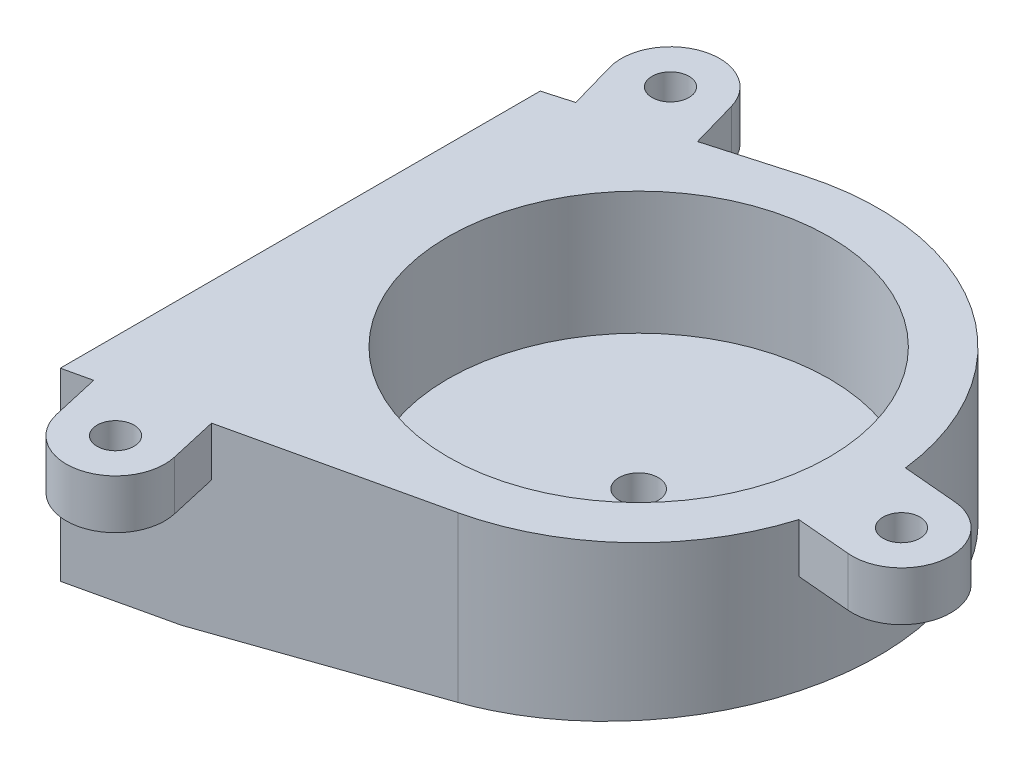
ISO-10303-21;
HEADER;
FILE_DESCRIPTION(('STEP AP214'),'2;1');
FILE_NAME('part.step','',(''),(''),'','','');
FILE_SCHEMA(('AUTOMOTIVE_DESIGN { 1 0 10303 214 1 1 1 1 }'));
ENDSEC;
DATA;
#1=APPLICATION_CONTEXT('core data for automotive mechanical design processes');
#2=APPLICATION_PROTOCOL_DEFINITION('international standard','automotive_design',2000,#1);
#3=PRODUCT_CONTEXT('',#1,'mechanical');
#4=PRODUCT('Part','Part','',(#3));
#5=PRODUCT_RELATED_PRODUCT_CATEGORY('part','',(#4));
#6=PRODUCT_DEFINITION_FORMATION('','',#4);
#7=PRODUCT_DEFINITION_CONTEXT('part definition',#1,'design');
#8=PRODUCT_DEFINITION('design','',#6,#7);
#9=PRODUCT_DEFINITION_SHAPE('','',#8);
#10=(LENGTH_UNIT() NAMED_UNIT(*) SI_UNIT(.MILLI.,.METRE.));
#11=(NAMED_UNIT(*) PLANE_ANGLE_UNIT() SI_UNIT($,.RADIAN.));
#12=(NAMED_UNIT(*) SI_UNIT($,.STERADIAN.) SOLID_ANGLE_UNIT());
#13=UNCERTAINTY_MEASURE_WITH_UNIT(LENGTH_MEASURE(1.E-05),#10,'distance_accuracy_value','');
#14=(GEOMETRIC_REPRESENTATION_CONTEXT(3) GLOBAL_UNCERTAINTY_ASSIGNED_CONTEXT((#13)) GLOBAL_UNIT_ASSIGNED_CONTEXT((#10,
#11,#12)) REPRESENTATION_CONTEXT('',''));
#15=CARTESIAN_POINT('',(0.,0.,0.));
#16=DIRECTION('',(0.,0.,1.));
#17=DIRECTION('',(1.,0.,0.));
#18=AXIS2_PLACEMENT_3D('',#15,#16,#17);
#19=CARTESIAN_POINT('',(4.32348319389158,15.,19.0146652106246));
#20=DIRECTION('',(0.221717086866235,0.,0.975111036442287));
#21=DIRECTION('',(0.975111036442287,0.,-0.221717086866235));
#22=AXIS2_PLACEMENT_3D('',#19,#20,#21);
#23=PLANE('',#22);
#24=DIRECTION('',(0.975111036442287,0.,-0.221717086866235));
#25=VECTOR('',#24,1.);
#26=CARTESIAN_POINT('',(4.32348319389158,11.,19.0146652106246));
#27=LINE('',#26,#25);
#28=CARTESIAN_POINT('',(-19.7873124932341,11.,24.4968874212158));
#29=VERTEX_POINT('',#28);
#30=CARTESIAN_POINT('',(-11.9864242016958,11.,22.7231507262859));
#31=VERTEX_POINT('',#30);
#32=EDGE_CURVE('E207',#29,#31,#27,.T.);
#33=ORIENTED_EDGE('',*,*,#32,.F.);
#34=DIRECTION('',(0.,1.,0.));
#35=VECTOR('',#34,1.);
#36=CARTESIAN_POINT('',(-19.7873124932341,11.,24.4968874212158));
#37=LINE('',#36,#35);
#38=CARTESIAN_POINT('',(-19.7873124932341,15.,24.4968874212158));
#39=VERTEX_POINT('',#38);
#40=EDGE_CURVE('E221',#29,#39,#37,.T.);
#41=ORIENTED_EDGE('',*,*,#40,.T.);
#42=DIRECTION('',(-0.975111036442287,0.,0.221717086866235));
#43=VECTOR('',#42,1.);
#44=CARTESIAN_POINT('',(4.32348319389158,15.,19.0146652106246));
#45=LINE('',#44,#43);
#46=CARTESIAN_POINT('',(-22.,15.,25.));
#47=VERTEX_POINT('',#46);
#48=EDGE_CURVE('E305',#39,#47,#45,.T.);
#49=ORIENTED_EDGE('',*,*,#48,.T.);
#50=DIRECTION('',(0.,-1.,0.));
#51=VECTOR('',#50,1.);
#52=CARTESIAN_POINT('',(-22.,15.,25.));
#53=LINE('',#52,#51);
#54=CARTESIAN_POINT('',(-22.,0.,25.));
#55=VERTEX_POINT('',#54);
#56=EDGE_CURVE('E320',#47,#55,#53,.T.);
#57=ORIENTED_EDGE('',*,*,#56,.T.);
#58=DIRECTION('',(-0.975111036442287,0.,0.221717086866235));
#59=VECTOR('',#58,1.);
#60=CARTESIAN_POINT('',(4.32348319389158,0.,19.0146652106246));
#61=LINE('',#60,#59);
#62=CARTESIAN_POINT('',(-14.,0.,23.1809900322722));
#63=VERTEX_POINT('',#62);
#64=EDGE_CURVE('E314',#63,#55,#61,.T.);
#65=ORIENTED_EDGE('',*,*,#64,.F.);
#66=DIRECTION('',(0.971414372160437,0.0869923318352629,-0.220876553219231));
#67=VECTOR('',#66,1.);
#68=CARTESIAN_POINT('',(5.4524012180103,1.7420060792248,18.7579760682972));
#69=LINE('',#68,#67);
#70=CARTESIAN_POINT('',(4.32348319389158,1.64090894273656,19.0146652106246));
#71=VERTEX_POINT('',#70);
#72=EDGE_CURVE('E288',#63,#71,#69,.T.);
#73=ORIENTED_EDGE('',*,*,#72,.T.);
#74=DIRECTION('',(0.,-1.,0.));
#75=VECTOR('',#74,1.);
#76=CARTESIAN_POINT('',(4.32348319389158,15.,19.0146652106246));
#77=LINE('',#76,#75);
#78=CARTESIAN_POINT('',(4.32348319389158,15.,19.0146652106246));
#79=VERTEX_POINT('',#78);
#80=EDGE_CURVE('E323',#79,#71,#77,.T.);
#81=ORIENTED_EDGE('',*,*,#80,.F.);
#82=CARTESIAN_POINT('',(-11.9864242016958,15.,22.7231507262859));
#83=VERTEX_POINT('',#82);
#84=EDGE_CURVE('E306',#79,#83,#45,.T.);
#85=ORIENTED_EDGE('',*,*,#84,.T.);
#86=DIRECTION('',(0.,1.,0.));
#87=VECTOR('',#86,1.);
#88=CARTESIAN_POINT('',(-11.9864242016958,11.,22.7231507262859));
#89=LINE('',#88,#87);
#90=EDGE_CURVE('E225',#31,#83,#89,.T.);
#91=ORIENTED_EDGE('',*,*,#90,.F.);
#92=EDGE_LOOP('',(#33,#41,#49,#57,#65,#73,#81,#85,#91));
#93=FACE_BOUND('',#92,.T.);
#94=ADVANCED_FACE('F34',(#93),#23,.T.);
#95=CARTESIAN_POINT('',(-5.35142928494359,15.,-18.7513254093743));
#96=DIRECTION('',(-0.274432271022749,0.,-0.961606431249967));
#97=DIRECTION('',(-0.961606431249967,0.,0.274432271022749));
#98=AXIS2_PLACEMENT_3D('',#95,#96,#97);
#99=PLANE('',#98);
#100=DIRECTION('',(-0.961606431249967,0.,0.274432271022748));
#101=VECTOR('',#100,1.);
#102=CARTESIAN_POINT('',(-5.35142928494359,11.,-18.7513254093743));
#103=LINE('',#102,#101);
#104=CARTESIAN_POINT('',(-12.0558451909091,11.,-16.8379562562963));
#105=VERTEX_POINT('',#104);
#106=CARTESIAN_POINT('',(-19.7486966409089,11.,-14.6424980881143));
#107=VERTEX_POINT('',#106);
#108=EDGE_CURVE('E244',#105,#107,#103,.T.);
#109=ORIENTED_EDGE('',*,*,#108,.F.);
#110=DIRECTION('',(0.,1.,0.));
#111=VECTOR('',#110,1.);
#112=CARTESIAN_POINT('',(-12.0558451909091,11.,-16.8379562562963));
#113=LINE('',#112,#111);
#114=CARTESIAN_POINT('',(-12.0558451909091,15.,-16.8379562562963));
#115=VERTEX_POINT('',#114);
#116=EDGE_CURVE('E258',#105,#115,#113,.T.);
#117=ORIENTED_EDGE('',*,*,#116,.T.);
#118=DIRECTION('',(0.961606431249967,0.,-0.274432271022748));
#119=VECTOR('',#118,1.);
#120=CARTESIAN_POINT('',(-5.35142928494359,15.,-18.7513254093743));
#121=LINE('',#120,#119);
#122=CARTESIAN_POINT('',(-5.3514292849436,15.,-18.7513254093743));
#123=VERTEX_POINT('',#122);
#124=EDGE_CURVE('E298',#115,#123,#121,.T.);
#125=ORIENTED_EDGE('',*,*,#124,.T.);
#126=DIRECTION('',(0.,-1.,0.));
#127=VECTOR('',#126,1.);
#128=CARTESIAN_POINT('',(-5.3514292849436,15.,-18.7513254093743));
#129=LINE('',#128,#127);
#130=CARTESIAN_POINT('',(-5.3514292849436,0.774498870005051,-18.7513254093743));
#131=VERTEX_POINT('',#130);
#132=EDGE_CURVE('E311',#123,#131,#129,.T.);
#133=ORIENTED_EDGE('',*,*,#132,.T.);
#134=DIRECTION('',(-0.958060684401584,-0.0857964792001418,0.273420352499275));
#135=VECTOR('',#134,1.);
#136=CARTESIAN_POINT('',(-4.18211822024305,0.879213293709578,-19.0850343786464));
#137=LINE('',#136,#135);
#138=CARTESIAN_POINT('',(-14.,0.,-16.2831151049272));
#139=VERTEX_POINT('',#138);
#140=EDGE_CURVE('E291',#131,#139,#137,.T.);
#141=ORIENTED_EDGE('',*,*,#140,.T.);
#142=DIRECTION('',(0.961606431249967,0.,-0.274432271022748));
#143=VECTOR('',#142,1.);
#144=CARTESIAN_POINT('',(-5.35142928494359,0.,-18.7513254093743));
#145=LINE('',#144,#143);
#146=CARTESIAN_POINT('',(-22.,0.,-14.));
#147=VERTEX_POINT('',#146);
#148=EDGE_CURVE('E294',#147,#139,#145,.T.);
#149=ORIENTED_EDGE('',*,*,#148,.F.);
#150=DIRECTION('',(0.,-1.,0.));
#151=VECTOR('',#150,1.);
#152=CARTESIAN_POINT('',(-22.,15.,-14.));
#153=LINE('',#152,#151);
#154=CARTESIAN_POINT('',(-22.,15.,-14.));
#155=VERTEX_POINT('',#154);
#156=EDGE_CURVE('E318',#155,#147,#153,.T.);
#157=ORIENTED_EDGE('',*,*,#156,.F.);
#158=CARTESIAN_POINT('',(-19.7486966409089,15.,-14.6424980881143));
#159=VERTEX_POINT('',#158);
#160=EDGE_CURVE('E300',#155,#159,#121,.T.);
#161=ORIENTED_EDGE('',*,*,#160,.T.);
#162=DIRECTION('',(0.,1.,0.));
#163=VECTOR('',#162,1.);
#164=CARTESIAN_POINT('',(-19.7486966409089,11.,-14.6424980881143));
#165=LINE('',#164,#163);
#166=EDGE_CURVE('E262',#107,#159,#165,.T.);
#167=ORIENTED_EDGE('',*,*,#166,.F.);
#168=EDGE_LOOP('',(#109,#117,#125,#133,#141,#149,#157,#161,#167));
#169=FACE_BOUND('',#168,.T.);
#170=ADVANCED_FACE('F367',(#169),#99,.T.);
#171=CARTESIAN_POINT('',(0.,15.,0.));
#172=DIRECTION('',(0.,-1.,0.));
#173=DIRECTION('',(0.,0.,-1.));
#174=AXIS2_PLACEMENT_3D('',#171,#172,#173);
#175=CYLINDRICAL_SURFACE('',#174,19.5);
#176=DIRECTION('',(0.,1.,0.));
#177=VECTOR('',#176,1.);
#178=CARTESIAN_POINT('',(18.664086252509,11.,5.64817531233798));
#179=LINE('',#178,#177);
#180=CARTESIAN_POINT('',(18.664086252509,11.,5.64817531233798));
#181=VERTEX_POINT('',#180);
#182=CARTESIAN_POINT('',(18.664086252509,15.,5.64817531233798));
#183=VERTEX_POINT('',#182);
#184=EDGE_CURVE('E174',#181,#183,#179,.T.);
#185=ORIENTED_EDGE('',*,*,#184,.T.);
#186=CARTESIAN_POINT('',(0.,15.,0.));
#187=DIRECTION('',(0.,-1.,0.));
#188=DIRECTION('',(0.,0.,-1.));
#189=AXIS2_PLACEMENT_3D('',#186,#187,#188);
#190=CIRCLE('',#189,19.5);
#191=EDGE_CURVE('E302',#183,#79,#190,.T.);
#192=ORIENTED_EDGE('',*,*,#191,.T.);
#193=ORIENTED_EDGE('',*,*,#80,.T.);
#194=CARTESIAN_POINT('',(0.,1.25373134328358,0.));
#195=DIRECTION('',(0.0891952975496599,-0.996014155971203,0.));
#196=DIRECTION('',(-0.996014155971203,-0.0891952975496599,0.));
#197=AXIS2_PLACEMENT_3D('',#194,#195,#196);
#198=ELLIPSE('',#197,19.5780349938759,19.5);
#199=EDGE_CURVE('E285',#71,#131,#198,.F.);
#200=ORIENTED_EDGE('',*,*,#199,.T.);
#201=ORIENTED_EDGE('',*,*,#132,.F.);
#202=CARTESIAN_POINT('',(19.3613321944903,15.,-2.32138227239599));
#203=VERTEX_POINT('',#202);
#204=EDGE_CURVE('E303',#123,#203,#190,.T.);
#205=ORIENTED_EDGE('',*,*,#204,.T.);
#206=DIRECTION('',(0.,1.,0.));
#207=VECTOR('',#206,1.);
#208=CARTESIAN_POINT('',(19.3613321944903,11.,-2.32138227239599));
#209=LINE('',#208,#207);
#210=CARTESIAN_POINT('',(19.3613321944903,11.,-2.32138227239599));
#211=VERTEX_POINT('',#210);
#212=EDGE_CURVE('E54',#211,#203,#209,.T.);
#213=ORIENTED_EDGE('',*,*,#212,.F.);
#214=CARTESIAN_POINT('',(0.,11.,0.));
#215=DIRECTION('',(0.,1.,0.));
#216=DIRECTION('',(0.,0.,1.));
#217=AXIS2_PLACEMENT_3D('',#214,#215,#216);
#218=CIRCLE('',#217,19.5);
#219=EDGE_CURVE('E49',#181,#211,#218,.T.);
#220=ORIENTED_EDGE('',*,*,#219,.F.);
#221=EDGE_LOOP('',(#185,#192,#193,#200,#201,#205,#213,#220));
#222=FACE_BOUND('',#221,.T.);
#223=ADVANCED_FACE('F373',(#222),#175,.T.);
#224=CARTESIAN_POINT('',(0.,0.,0.));
#225=DIRECTION('',(0.,1.,0.));
#226=DIRECTION('',(0.,0.,1.));
#227=AXIS2_PLACEMENT_3D('',#224,#225,#226);
#228=PLANE('',#227);
#229=CARTESIAN_POINT('',(-18.,0.,5.5));
#230=DIRECTION('',(0.,-1.,0.));
#231=DIRECTION('',(0.,0.,-1.));
#232=AXIS2_PLACEMENT_3D('',#229,#230,#231);
#233=CIRCLE('',#232,2.05);
#234=CARTESIAN_POINT('',(-18.,0.,3.45));
#235=VERTEX_POINT('',#234);
#236=EDGE_CURVE('E274',#235,#235,#233,.T.);
#237=ORIENTED_EDGE('',*,*,#236,.F.);
#238=EDGE_LOOP('',(#237));
#239=FACE_BOUND('',#238,.T.);
#240=DIRECTION('',(0.,0.,-1.));
#241=VECTOR('',#240,1.);
#242=CARTESIAN_POINT('',(-14.,0.,0.));
#243=LINE('',#242,#241);
#244=EDGE_CURVE('E11',#63,#139,#243,.T.);
#245=ORIENTED_EDGE('',*,*,#244,.F.);
#246=ORIENTED_EDGE('',*,*,#64,.T.);
#247=DIRECTION('',(0.,0.,-1.));
#248=VECTOR('',#247,1.);
#249=CARTESIAN_POINT('',(-22.,0.,0.));
#250=LINE('',#249,#248);
#251=EDGE_CURVE('E299',#55,#147,#250,.T.);
#252=ORIENTED_EDGE('',*,*,#251,.T.);
#253=ORIENTED_EDGE('',*,*,#148,.T.);
#254=EDGE_LOOP('',(#245,#246,#252,#253));
#255=FACE_BOUND('',#254,.T.);
#256=ADVANCED_FACE('F36',(#239,#255),#228,.F.);
#257=CARTESIAN_POINT('',(0.,5.,0.));
#258=DIRECTION('',(0.,1.,0.));
#259=DIRECTION('',(0.,0.,1.));
#260=AXIS2_PLACEMENT_3D('',#257,#258,#259);
#261=PLANE('',#260);
#262=CARTESIAN_POINT('',(0.,5.,0.));
#263=DIRECTION('',(0.,1.,0.));
#264=DIRECTION('',(0.,0.,1.));
#265=AXIS2_PLACEMENT_3D('',#262,#263,#264);
#266=CIRCLE('',#265,1.6);
#267=CARTESIAN_POINT('',(0.,5.,1.6));
#268=VERTEX_POINT('',#267);
#269=EDGE_CURVE('E280',#268,#268,#266,.T.);
#270=ORIENTED_EDGE('',*,*,#269,.F.);
#271=EDGE_LOOP('',(#270));
#272=FACE_BOUND('',#271,.T.);
#273=CARTESIAN_POINT('',(0.,5.,0.));
#274=DIRECTION('',(0.,1.,0.));
#275=DIRECTION('',(0.,0.,1.));
#276=AXIS2_PLACEMENT_3D('',#273,#274,#275);
#277=CIRCLE('',#276,15.5);
#278=CARTESIAN_POINT('',(0.,5.,15.5));
#279=VERTEX_POINT('',#278);
#280=EDGE_CURVE('E42',#279,#279,#277,.T.);
#281=ORIENTED_EDGE('',*,*,#280,.T.);
#282=EDGE_LOOP('',(#281));
#283=FACE_BOUND('',#282,.T.);
#284=ADVANCED_FACE('F330',(#272,#283),#261,.T.);
#285=CARTESIAN_POINT('',(-22.,15.,0.));
#286=DIRECTION('',(-1.,0.,0.));
#287=DIRECTION('',(0.,0.,1.));
#288=AXIS2_PLACEMENT_3D('',#285,#286,#287);
#289=PLANE('',#288);
#290=ORIENTED_EDGE('',*,*,#251,.F.);
#291=ORIENTED_EDGE('',*,*,#56,.F.);
#292=DIRECTION('',(0.,0.,-1.));
#293=VECTOR('',#292,1.);
#294=CARTESIAN_POINT('',(-22.,15.,0.));
#295=LINE('',#294,#293);
#296=EDGE_CURVE('E308',#47,#155,#295,.T.);
#297=ORIENTED_EDGE('',*,*,#296,.T.);
#298=ORIENTED_EDGE('',*,*,#156,.T.);
#299=EDGE_LOOP('',(#290,#291,#297,#298));
#300=FACE_BOUND('',#299,.T.);
#301=ADVANCED_FACE('F336',(#300),#289,.T.);
#302=CARTESIAN_POINT('',(0.,15.,0.));
#303=DIRECTION('',(0.,-1.,0.));
#304=DIRECTION('',(0.,0.,-1.));
#305=AXIS2_PLACEMENT_3D('',#302,#303,#304);
#306=CYLINDRICAL_SURFACE('',#305,15.5);
#307=ORIENTED_EDGE('',*,*,#280,.F.);
#308=EDGE_LOOP('',(#307));
#309=FACE_BOUND('',#308,.T.);
#310=CARTESIAN_POINT('',(0.,15.,0.));
#311=DIRECTION('',(0.,-1.,0.));
#312=DIRECTION('',(0.,0.,-1.));
#313=AXIS2_PLACEMENT_3D('',#310,#311,#312);
#314=CIRCLE('',#313,15.5);
#315=CARTESIAN_POINT('',(0.,15.,-15.5));
#316=VERTEX_POINT('',#315);
#317=EDGE_CURVE('E295',#316,#316,#314,.T.);
#318=ORIENTED_EDGE('',*,*,#317,.F.);
#319=EDGE_LOOP('',(#318));
#320=FACE_BOUND('',#319,.T.);
#321=ADVANCED_FACE('F332',(#309,#320),#306,.F.);
#322=CARTESIAN_POINT('',(0.,15.,0.));
#323=DIRECTION('',(0.,-1.,0.));
#324=DIRECTION('',(0.,0.,-1.));
#325=AXIS2_PLACEMENT_3D('',#322,#323,#324);
#326=PLANE('',#325);
#327=ORIENTED_EDGE('',*,*,#317,.T.);
#328=EDGE_LOOP('',(#327));
#329=FACE_BOUND('',#328,.T.);
#330=ORIENTED_EDGE('',*,*,#160,.F.);
#331=ORIENTED_EDGE('',*,*,#296,.F.);
#332=ORIENTED_EDGE('',*,*,#48,.F.);
#333=DIRECTION('',(-0.221717086866236,0.,-0.975111036442286));
#334=VECTOR('',#333,1.);
#335=CARTESIAN_POINT('',(-24.1107956871257,15.,5.48222221059121));
#336=LINE('',#335,#334);
#337=CARTESIAN_POINT('',(-18.9004441457691,15.,28.3973315669849));
#338=VERTEX_POINT('',#337);
#339=EDGE_CURVE('E213',#338,#39,#336,.T.);
#340=ORIENTED_EDGE('',*,*,#339,.F.);
#341=CARTESIAN_POINT('',(-15.,15.,27.51046321952));
#342=DIRECTION('',(0.,1.,0.));
#343=DIRECTION('',(0.,0.,1.));
#344=AXIS2_PLACEMENT_3D('',#341,#342,#343);
#345=CIRCLE('',#344,4.);
#346=CARTESIAN_POINT('',(-11.0995558542309,15.,26.623594872055));
#347=VERTEX_POINT('',#346);
#348=EDGE_CURVE('E216',#338,#347,#345,.T.);
#349=ORIENTED_EDGE('',*,*,#348,.T.);
#350=DIRECTION('',(-0.221717086866235,0.,-0.975111036442287));
#351=VECTOR('',#350,1.);
#352=CARTESIAN_POINT('',(-16.3099073955874,15.,3.7084855156613));
#353=LINE('',#352,#351);
#354=EDGE_CURVE('E198',#347,#83,#353,.T.);
#355=ORIENTED_EDGE('',*,*,#354,.T.);
#356=ORIENTED_EDGE('',*,*,#84,.F.);
#357=ORIENTED_EDGE('',*,*,#191,.F.);
#358=DIRECTION('',(0.996194698091746,0.,0.0871557427476584));
#359=VECTOR('',#358,1.);
#360=CARTESIAN_POINT('',(-0.348622970990634,15.,3.98477879236698));
#361=LINE('',#360,#359);
#362=CARTESIAN_POINT('',(23.0619524341654,15.,6.03293874693695));
#363=VERTEX_POINT('',#362);
#364=EDGE_CURVE('E185',#183,#363,#361,.T.);
#365=ORIENTED_EDGE('',*,*,#364,.T.);
#366=CARTESIAN_POINT('',(23.410575405156,15.,2.04815995456997));
#367=DIRECTION('',(0.,1.,0.));
#368=DIRECTION('',(0.,0.,1.));
#369=AXIS2_PLACEMENT_3D('',#366,#367,#368);
#370=CIRCLE('',#369,3.99999999999999);
#371=CARTESIAN_POINT('',(23.7591983761467,15.,-1.93661883779701));
#372=VERTEX_POINT('',#371);
#373=EDGE_CURVE('E156',#363,#372,#370,.T.);
#374=ORIENTED_EDGE('',*,*,#373,.T.);
#375=DIRECTION('',(0.996194698091746,0.,0.0871557427476586));
#376=VECTOR('',#375,1.);
#377=CARTESIAN_POINT('',(0.348622970990635,15.,-3.98477879236699));
#378=LINE('',#377,#376);
#379=EDGE_CURVE('E178',#203,#372,#378,.T.);
#380=ORIENTED_EDGE('',*,*,#379,.F.);
#381=ORIENTED_EDGE('',*,*,#204,.F.);
#382=ORIENTED_EDGE('',*,*,#124,.F.);
#383=DIRECTION('',(0.274432271022749,0.,0.961606431249967));
#384=VECTOR('',#383,1.);
#385=CARTESIAN_POINT('',(-6.70441590596554,15.,1.91336915307806));
#386=LINE('',#385,#384);
#387=CARTESIAN_POINT('',(-13.1535742750001,15.,-20.6843819812962));
#388=VERTEX_POINT('',#387);
#389=EDGE_CURVE('E250',#388,#115,#386,.T.);
#390=ORIENTED_EDGE('',*,*,#389,.F.);
#391=CARTESIAN_POINT('',(-17.,15.,-19.5866528972052));
#392=DIRECTION('',(0.,1.,0.));
#393=DIRECTION('',(0.,0.,1.));
#394=AXIS2_PLACEMENT_3D('',#391,#392,#393);
#395=CIRCLE('',#394,4.);
#396=CARTESIAN_POINT('',(-20.8464257249999,15.,-18.4889238131142));
#397=VERTEX_POINT('',#396);
#398=EDGE_CURVE('E253',#388,#397,#395,.T.);
#399=ORIENTED_EDGE('',*,*,#398,.T.);
#400=DIRECTION('',(0.274432271022748,0.,0.961606431249967));
#401=VECTOR('',#400,1.);
#402=CARTESIAN_POINT('',(-14.3972673559653,15.,4.10882732126004));
#403=LINE('',#402,#401);
#404=EDGE_CURVE('E235',#397,#159,#403,.T.);
#405=ORIENTED_EDGE('',*,*,#404,.T.);
#406=EDGE_LOOP('',(#330,#331,#332,#340,#349,#355,#356,#357,#365,#374,#380,#381,#382,#390,#399,#405));
#407=FACE_BOUND('',#406,.T.);
#408=CARTESIAN_POINT('',(-17.,15.,-19.5866528972052));
#409=DIRECTION('',(0.,1.,0.));
#410=DIRECTION('',(0.,0.,1.));
#411=AXIS2_PLACEMENT_3D('',#408,#409,#410);
#412=CIRCLE('',#411,1.5);
#413=CARTESIAN_POINT('',(-17.,15.,-18.0866528972052));
#414=VERTEX_POINT('',#413);
#415=EDGE_CURVE('E224',#414,#414,#412,.T.);
#416=ORIENTED_EDGE('',*,*,#415,.F.);
#417=EDGE_LOOP('',(#416));
#418=FACE_BOUND('',#417,.T.);
#419=CARTESIAN_POINT('',(-15.,15.,27.51046321952));
#420=DIRECTION('',(0.,1.,0.));
#421=DIRECTION('',(0.,0.,1.));
#422=AXIS2_PLACEMENT_3D('',#419,#420,#421);
#423=CIRCLE('',#422,1.5);
#424=CARTESIAN_POINT('',(-15.,15.,29.01046321952));
#425=VERTEX_POINT('',#424);
#426=EDGE_CURVE('E191',#425,#425,#423,.T.);
#427=ORIENTED_EDGE('',*,*,#426,.F.);
#428=EDGE_LOOP('',(#427));
#429=FACE_BOUND('',#428,.T.);
#430=CARTESIAN_POINT('',(23.410575405156,15.,2.04815995456997));
#431=DIRECTION('',(0.,1.,0.));
#432=DIRECTION('',(0.,0.,1.));
#433=AXIS2_PLACEMENT_3D('',#430,#431,#432);
#434=CIRCLE('',#433,1.5);
#435=CARTESIAN_POINT('',(23.410575405156,15.,3.54815995456997));
#436=VERTEX_POINT('',#435);
#437=EDGE_CURVE('E175',#436,#436,#434,.T.);
#438=ORIENTED_EDGE('',*,*,#437,.F.);
#439=EDGE_LOOP('',(#438));
#440=FACE_BOUND('',#439,.T.);
#441=ADVANCED_FACE('F335',(#329,#407,#418,#429,#440),#326,.F.);
#442=CARTESIAN_POINT('',(-0.111381215469613,1.24375690607735,-23.5866528972052));
#443=DIRECTION('',(0.0891952975496599,-0.996014155971203,0.));
#444=DIRECTION('',(0.996014155971203,0.0891952975496599,0.));
#445=AXIS2_PLACEMENT_3D('',#442,#443,#444);
#446=PLANE('',#445);
#447=CARTESIAN_POINT('',(0.,1.25373134328358,0.));
#448=DIRECTION('',(0.0891952975496599,-0.996014155971203,0.));
#449=DIRECTION('',(0.996014155971203,0.0891952975496599,0.));
#450=AXIS2_PLACEMENT_3D('',#447,#448,#449);
#451=ELLIPSE('',#450,4.01600717823096,4.);
#452=CARTESIAN_POINT('',(4.,1.61194029850746,0.));
#453=VERTEX_POINT('',#452);
#454=EDGE_CURVE('E261',#453,#453,#451,.F.);
#455=ORIENTED_EDGE('',*,*,#454,.T.);
#456=EDGE_LOOP('',(#455));
#457=FACE_BOUND('',#456,.T.);
#458=ORIENTED_EDGE('',*,*,#199,.F.);
#459=ORIENTED_EDGE('',*,*,#72,.F.);
#460=ORIENTED_EDGE('',*,*,#244,.T.);
#461=ORIENTED_EDGE('',*,*,#140,.F.);
#462=EDGE_LOOP('',(#458,#459,#460,#461));
#463=FACE_BOUND('',#462,.T.);
#464=ADVANCED_FACE('F342',(#457,#463),#446,.T.);
#465=CARTESIAN_POINT('',(0.,0.,0.));
#466=DIRECTION('',(0.,1.,0.));
#467=DIRECTION('',(0.,0.,1.));
#468=AXIS2_PLACEMENT_3D('',#465,#466,#467);
#469=CYLINDRICAL_SURFACE('',#468,1.6);
#470=CARTESIAN_POINT('',(0.,2.,0.));
#471=DIRECTION('',(0.,1.,0.));
#472=DIRECTION('',(0.,0.,1.));
#473=AXIS2_PLACEMENT_3D('',#470,#471,#472);
#474=CIRCLE('',#473,1.6);
#475=CARTESIAN_POINT('',(0.,2.,1.6));
#476=VERTEX_POINT('',#475);
#477=EDGE_CURVE('E271',#476,#476,#474,.T.);
#478=ORIENTED_EDGE('',*,*,#477,.F.);
#479=EDGE_LOOP('',(#478));
#480=FACE_BOUND('',#479,.T.);
#481=ORIENTED_EDGE('',*,*,#269,.T.);
#482=EDGE_LOOP('',(#481));
#483=FACE_BOUND('',#482,.T.);
#484=ADVANCED_FACE('F389',(#480,#483),#469,.F.);
#485=CARTESIAN_POINT('',(-18.,6.,5.5));
#486=DIRECTION('',(0.,-1.,0.));
#487=DIRECTION('',(0.,0.,-1.));
#488=AXIS2_PLACEMENT_3D('',#485,#486,#487);
#489=CYLINDRICAL_SURFACE('',#488,2.05);
#490=CARTESIAN_POINT('',(-18.,6.,5.5));
#491=DIRECTION('',(0.,-1.,0.));
#492=DIRECTION('',(0.,0.,-1.));
#493=AXIS2_PLACEMENT_3D('',#490,#491,#492);
#494=CIRCLE('',#493,2.05);
#495=CARTESIAN_POINT('',(-18.,6.,3.45));
#496=VERTEX_POINT('',#495);
#497=EDGE_CURVE('E277',#496,#496,#494,.T.);
#498=ORIENTED_EDGE('',*,*,#497,.F.);
#499=EDGE_LOOP('',(#498));
#500=FACE_BOUND('',#499,.T.);
#501=ORIENTED_EDGE('',*,*,#236,.T.);
#502=EDGE_LOOP('',(#501));
#503=FACE_BOUND('',#502,.T.);
#504=ADVANCED_FACE('F391',(#500,#503),#489,.F.);
#505=CARTESIAN_POINT('',(-18.,6.,5.5));
#506=DIRECTION('',(0.,-1.,0.));
#507=DIRECTION('',(0.,0.,-1.));
#508=AXIS2_PLACEMENT_3D('',#505,#506,#507);
#509=PLANE('',#508);
#510=ORIENTED_EDGE('',*,*,#497,.T.);
#511=EDGE_LOOP('',(#510));
#512=FACE_BOUND('',#511,.T.);
#513=ADVANCED_FACE('F398',(#512),#509,.T.);
#514=CARTESIAN_POINT('',(0.,-0.00100000000000013,0.));
#515=DIRECTION('',(0.,1.,0.));
#516=DIRECTION('',(0.,0.,1.));
#517=AXIS2_PLACEMENT_3D('',#514,#515,#516);
#518=CYLINDRICAL_SURFACE('',#517,4.);
#519=ORIENTED_EDGE('',*,*,#454,.F.);
#520=EDGE_LOOP('',(#519));
#521=FACE_BOUND('',#520,.T.);
#522=CARTESIAN_POINT('',(0.,2.,0.));
#523=DIRECTION('',(0.,1.,0.));
#524=DIRECTION('',(0.,0.,1.));
#525=AXIS2_PLACEMENT_3D('',#522,#523,#524);
#526=CIRCLE('',#525,4.);
#527=CARTESIAN_POINT('',(0.,2.,4.));
#528=VERTEX_POINT('',#527);
#529=EDGE_CURVE('E268',#528,#528,#526,.T.);
#530=ORIENTED_EDGE('',*,*,#529,.T.);
#531=EDGE_LOOP('',(#530));
#532=FACE_BOUND('',#531,.T.);
#533=ADVANCED_FACE('F407',(#521,#532),#518,.F.);
#534=CARTESIAN_POINT('',(0.,2.,0.));
#535=DIRECTION('',(0.,1.,0.));
#536=DIRECTION('',(0.,0.,1.));
#537=AXIS2_PLACEMENT_3D('',#534,#535,#536);
#538=PLANE('',#537);
#539=ORIENTED_EDGE('',*,*,#477,.T.);
#540=EDGE_LOOP('',(#539));
#541=FACE_BOUND('',#540,.T.);
#542=ORIENTED_EDGE('',*,*,#529,.F.);
#543=EDGE_LOOP('',(#542));
#544=FACE_BOUND('',#543,.T.);
#545=ADVANCED_FACE('F411',(#541,#544),#538,.F.);
#546=CARTESIAN_POINT('',(-6.70441590596554,11.,1.91336915307806));
#547=DIRECTION('',(-0.961606431249967,0.,0.274432271022749));
#548=DIRECTION('',(0.274432271022749,0.,0.961606431249967));
#549=AXIS2_PLACEMENT_3D('',#546,#547,#548);
#550=PLANE('',#549);
#551=ORIENTED_EDGE('',*,*,#389,.T.);
#552=ORIENTED_EDGE('',*,*,#116,.F.);
#553=DIRECTION('',(0.274432271022749,0.,0.961606431249967));
#554=VECTOR('',#553,1.);
#555=CARTESIAN_POINT('',(-6.70441590596554,11.,1.91336915307806));
#556=LINE('',#555,#554);
#557=CARTESIAN_POINT('',(-13.1535742750001,11.,-20.6843819812962));
#558=VERTEX_POINT('',#557);
#559=EDGE_CURVE('E234',#558,#105,#556,.T.);
#560=ORIENTED_EDGE('',*,*,#559,.F.);
#561=DIRECTION('',(0.,1.,0.));
#562=VECTOR('',#561,1.);
#563=CARTESIAN_POINT('',(-13.1535742750001,11.,-20.6843819812962));
#564=LINE('',#563,#562);
#565=EDGE_CURVE('E247',#558,#388,#564,.T.);
#566=ORIENTED_EDGE('',*,*,#565,.T.);
#567=EDGE_LOOP('',(#551,#552,#560,#566));
#568=FACE_BOUND('',#567,.T.);
#569=ADVANCED_FACE('F415',(#568),#550,.F.);
#570=CARTESIAN_POINT('',(-14.3972673559653,11.,4.10882732126004));
#571=DIRECTION('',(-0.961606431249967,0.,0.274432271022748));
#572=DIRECTION('',(0.274432271022748,0.,0.961606431249967));
#573=AXIS2_PLACEMENT_3D('',#570,#571,#572);
#574=PLANE('',#573);
#575=ORIENTED_EDGE('',*,*,#404,.F.);
#576=DIRECTION('',(0.,1.,0.));
#577=VECTOR('',#576,1.);
#578=CARTESIAN_POINT('',(-20.8464257249999,11.,-18.4889238131142));
#579=LINE('',#578,#577);
#580=CARTESIAN_POINT('',(-20.8464257249999,11.,-18.4889238131142));
#581=VERTEX_POINT('',#580);
#582=EDGE_CURVE('E265',#581,#397,#579,.T.);
#583=ORIENTED_EDGE('',*,*,#582,.F.);
#584=DIRECTION('',(0.274432271022748,0.,0.961606431249967));
#585=VECTOR('',#584,1.);
#586=CARTESIAN_POINT('',(-14.3972673559653,11.,4.10882732126004));
#587=LINE('',#586,#585);
#588=EDGE_CURVE('E241',#581,#107,#587,.T.);
#589=ORIENTED_EDGE('',*,*,#588,.T.);
#590=ORIENTED_EDGE('',*,*,#166,.T.);
#591=EDGE_LOOP('',(#575,#583,#589,#590));
#592=FACE_BOUND('',#591,.T.);
#593=ADVANCED_FACE('F421',(#592),#574,.T.);
#594=CARTESIAN_POINT('',(-17.,11.,-19.5866528972052));
#595=DIRECTION('',(0.,1.,0.));
#596=DIRECTION('',(0.,0.,1.));
#597=AXIS2_PLACEMENT_3D('',#594,#595,#596);
#598=CYLINDRICAL_SURFACE('',#597,1.5);
#599=CARTESIAN_POINT('',(-17.,11.,-19.5866528972052));
#600=DIRECTION('',(0.,1.,0.));
#601=DIRECTION('',(0.,0.,1.));
#602=AXIS2_PLACEMENT_3D('',#599,#600,#601);
#603=CIRCLE('',#602,1.5);
#604=CARTESIAN_POINT('',(-17.,11.,-18.0866528972052));
#605=VERTEX_POINT('',#604);
#606=EDGE_CURVE('E231',#605,#605,#603,.T.);
#607=ORIENTED_EDGE('',*,*,#606,.F.);
#608=EDGE_LOOP('',(#607));
#609=FACE_BOUND('',#608,.T.);
#610=ORIENTED_EDGE('',*,*,#415,.T.);
#611=EDGE_LOOP('',(#610));
#612=FACE_BOUND('',#611,.T.);
#613=ADVANCED_FACE('F417',(#609,#612),#598,.F.);
#614=CARTESIAN_POINT('',(-17.,11.,-19.5866528972052));
#615=DIRECTION('',(0.,1.,0.));
#616=DIRECTION('',(0.,0.,1.));
#617=AXIS2_PLACEMENT_3D('',#614,#615,#616);
#618=CYLINDRICAL_SURFACE('',#617,4.);
#619=ORIENTED_EDGE('',*,*,#398,.F.);
#620=ORIENTED_EDGE('',*,*,#565,.F.);
#621=CARTESIAN_POINT('',(-17.,11.,-19.5866528972052));
#622=DIRECTION('',(0.,1.,0.));
#623=DIRECTION('',(0.,0.,1.));
#624=AXIS2_PLACEMENT_3D('',#621,#622,#623);
#625=CIRCLE('',#624,4.);
#626=EDGE_CURVE('E238',#558,#581,#625,.T.);
#627=ORIENTED_EDGE('',*,*,#626,.T.);
#628=ORIENTED_EDGE('',*,*,#582,.T.);
#629=EDGE_LOOP('',(#619,#620,#627,#628));
#630=FACE_BOUND('',#629,.T.);
#631=ADVANCED_FACE('F420',(#630),#618,.T.);
#632=CARTESIAN_POINT('',(0.,11.,0.));
#633=DIRECTION('',(0.,1.,0.));
#634=DIRECTION('',(0.,0.,1.));
#635=AXIS2_PLACEMENT_3D('',#632,#633,#634);
#636=PLANE('',#635);
#637=ORIENTED_EDGE('',*,*,#606,.T.);
#638=EDGE_LOOP('',(#637));
#639=FACE_BOUND('',#638,.T.);
#640=ORIENTED_EDGE('',*,*,#559,.T.);
#641=ORIENTED_EDGE('',*,*,#108,.T.);
#642=ORIENTED_EDGE('',*,*,#588,.F.);
#643=ORIENTED_EDGE('',*,*,#626,.F.);
#644=EDGE_LOOP('',(#640,#641,#642,#643));
#645=FACE_BOUND('',#644,.T.);
#646=ADVANCED_FACE('F428',(#639,#645),#636,.F.);
#647=CARTESIAN_POINT('',(-24.1107956871257,11.,5.48222221059121));
#648=DIRECTION('',(0.975111036442286,0.,-0.221717086866236));
#649=DIRECTION('',(-0.221717086866236,0.,-0.975111036442286));
#650=AXIS2_PLACEMENT_3D('',#647,#648,#649);
#651=PLANE('',#650);
#652=ORIENTED_EDGE('',*,*,#339,.T.);
#653=ORIENTED_EDGE('',*,*,#40,.F.);
#654=DIRECTION('',(-0.221717086866236,0.,-0.975111036442286));
#655=VECTOR('',#654,1.);
#656=CARTESIAN_POINT('',(-24.1107956871257,11.,5.48222221059121));
#657=LINE('',#656,#655);
#658=CARTESIAN_POINT('',(-18.9004441457691,11.,28.3973315669849));
#659=VERTEX_POINT('',#658);
#660=EDGE_CURVE('E197',#659,#29,#657,.T.);
#661=ORIENTED_EDGE('',*,*,#660,.F.);
#662=DIRECTION('',(0.,1.,0.));
#663=VECTOR('',#662,1.);
#664=CARTESIAN_POINT('',(-18.9004441457691,11.,28.3973315669849));
#665=LINE('',#664,#663);
#666=EDGE_CURVE('E210',#659,#338,#665,.T.);
#667=ORIENTED_EDGE('',*,*,#666,.T.);
#668=EDGE_LOOP('',(#652,#653,#661,#667));
#669=FACE_BOUND('',#668,.T.);
#670=ADVANCED_FACE('F435',(#669),#651,.F.);
#671=CARTESIAN_POINT('',(-16.3099073955874,11.,3.7084855156613));
#672=DIRECTION('',(0.975111036442287,0.,-0.221717086866235));
#673=DIRECTION('',(-0.221717086866235,0.,-0.975111036442287));
#674=AXIS2_PLACEMENT_3D('',#671,#672,#673);
#675=PLANE('',#674);
#676=ORIENTED_EDGE('',*,*,#354,.F.);
#677=DIRECTION('',(0.,1.,0.));
#678=VECTOR('',#677,1.);
#679=CARTESIAN_POINT('',(-11.0995558542309,11.,26.623594872055));
#680=LINE('',#679,#678);
#681=CARTESIAN_POINT('',(-11.0995558542309,11.,26.623594872055));
#682=VERTEX_POINT('',#681);
#683=EDGE_CURVE('E228',#682,#347,#680,.T.);
#684=ORIENTED_EDGE('',*,*,#683,.F.);
#685=DIRECTION('',(-0.221717086866235,0.,-0.975111036442287));
#686=VECTOR('',#685,1.);
#687=CARTESIAN_POINT('',(-16.3099073955874,11.,3.7084855156613));
#688=LINE('',#687,#686);
#689=EDGE_CURVE('E204',#682,#31,#688,.T.);
#690=ORIENTED_EDGE('',*,*,#689,.T.);
#691=ORIENTED_EDGE('',*,*,#90,.T.);
#692=EDGE_LOOP('',(#676,#684,#690,#691));
#693=FACE_BOUND('',#692,.T.);
#694=ADVANCED_FACE('F441',(#693),#675,.T.);
#695=CARTESIAN_POINT('',(-15.,11.,27.51046321952));
#696=DIRECTION('',(0.,1.,0.));
#697=DIRECTION('',(0.,0.,1.));
#698=AXIS2_PLACEMENT_3D('',#695,#696,#697);
#699=CYLINDRICAL_SURFACE('',#698,1.5);
#700=CARTESIAN_POINT('',(-15.,11.,27.51046321952));
#701=DIRECTION('',(0.,1.,0.));
#702=DIRECTION('',(0.,0.,1.));
#703=AXIS2_PLACEMENT_3D('',#700,#701,#702);
#704=CIRCLE('',#703,1.5);
#705=CARTESIAN_POINT('',(-15.,11.,29.01046321952));
#706=VERTEX_POINT('',#705);
#707=EDGE_CURVE('E194',#706,#706,#704,.T.);
#708=ORIENTED_EDGE('',*,*,#707,.F.);
#709=EDGE_LOOP('',(#708));
#710=FACE_BOUND('',#709,.T.);
#711=ORIENTED_EDGE('',*,*,#426,.T.);
#712=EDGE_LOOP('',(#711));
#713=FACE_BOUND('',#712,.T.);
#714=ADVANCED_FACE('F437',(#710,#713),#699,.F.);
#715=CARTESIAN_POINT('',(-15.,11.,27.51046321952));
#716=DIRECTION('',(0.,1.,0.));
#717=DIRECTION('',(0.,0.,1.));
#718=AXIS2_PLACEMENT_3D('',#715,#716,#717);
#719=CYLINDRICAL_SURFACE('',#718,4.);
#720=ORIENTED_EDGE('',*,*,#348,.F.);
#721=ORIENTED_EDGE('',*,*,#666,.F.);
#722=CARTESIAN_POINT('',(-15.,11.,27.51046321952));
#723=DIRECTION('',(0.,1.,0.));
#724=DIRECTION('',(0.,0.,1.));
#725=AXIS2_PLACEMENT_3D('',#722,#723,#724);
#726=CIRCLE('',#725,4.);
#727=EDGE_CURVE('E201',#659,#682,#726,.T.);
#728=ORIENTED_EDGE('',*,*,#727,.T.);
#729=ORIENTED_EDGE('',*,*,#683,.T.);
#730=EDGE_LOOP('',(#720,#721,#728,#729));
#731=FACE_BOUND('',#730,.T.);
#732=ADVANCED_FACE('F440',(#731),#719,.T.);
#733=CARTESIAN_POINT('',(0.,11.,0.));
#734=DIRECTION('',(0.,1.,0.));
#735=DIRECTION('',(0.,0.,1.));
#736=AXIS2_PLACEMENT_3D('',#733,#734,#735);
#737=PLANE('',#736);
#738=ORIENTED_EDGE('',*,*,#707,.T.);
#739=EDGE_LOOP('',(#738));
#740=FACE_BOUND('',#739,.T.);
#741=ORIENTED_EDGE('',*,*,#660,.T.);
#742=ORIENTED_EDGE('',*,*,#32,.T.);
#743=ORIENTED_EDGE('',*,*,#689,.F.);
#744=ORIENTED_EDGE('',*,*,#727,.F.);
#745=EDGE_LOOP('',(#741,#742,#743,#744));
#746=FACE_BOUND('',#745,.T.);
#747=ADVANCED_FACE('F448',(#740,#746),#737,.F.);
#748=CARTESIAN_POINT('',(-0.348622970990634,11.,3.98477879236698));
#749=DIRECTION('',(-0.0871557427476584,0.,0.996194698091746));
#750=DIRECTION('',(0.996194698091746,0.,0.0871557427476584));
#751=AXIS2_PLACEMENT_3D('',#748,#749,#750);
#752=PLANE('',#751);
#753=ORIENTED_EDGE('',*,*,#364,.F.);
#754=ORIENTED_EDGE('',*,*,#184,.F.);
#755=DIRECTION('',(0.996194698091746,0.,0.0871557427476584));
#756=VECTOR('',#755,1.);
#757=CARTESIAN_POINT('',(-0.348622970990634,11.,3.98477879236698));
#758=LINE('',#757,#756);
#759=CARTESIAN_POINT('',(23.0619524341654,11.,6.03293874693695));
#760=VERTEX_POINT('',#759);
#761=EDGE_CURVE('E168',#181,#760,#758,.T.);
#762=ORIENTED_EDGE('',*,*,#761,.T.);
#763=DIRECTION('',(0.,1.,0.));
#764=VECTOR('',#763,1.);
#765=CARTESIAN_POINT('',(23.0619524341654,11.,6.03293874693695));
#766=LINE('',#765,#764);
#767=EDGE_CURVE('E151',#760,#363,#766,.T.);
#768=ORIENTED_EDGE('',*,*,#767,.T.);
#769=EDGE_LOOP('',(#753,#754,#762,#768));
#770=FACE_BOUND('',#769,.T.);
#771=ADVANCED_FACE('F173',(#770),#752,.T.);
#772=CARTESIAN_POINT('',(0.348622970990635,11.,-3.98477879236699));
#773=DIRECTION('',(-0.0871557427476586,0.,0.996194698091746));
#774=DIRECTION('',(0.996194698091746,0.,0.0871557427476586));
#775=AXIS2_PLACEMENT_3D('',#772,#773,#774);
#776=PLANE('',#775);
#777=ORIENTED_EDGE('',*,*,#379,.T.);
#778=DIRECTION('',(0.,1.,0.));
#779=VECTOR('',#778,1.);
#780=CARTESIAN_POINT('',(23.7591983761467,11.,-1.93661883779701));
#781=LINE('',#780,#779);
#782=CARTESIAN_POINT('',(23.7591983761467,11.,-1.93661883779701));
#783=VERTEX_POINT('',#782);
#784=EDGE_CURVE('E161',#783,#372,#781,.T.);
#785=ORIENTED_EDGE('',*,*,#784,.F.);
#786=DIRECTION('',(0.996194698091746,0.,0.0871557427476586));
#787=VECTOR('',#786,1.);
#788=CARTESIAN_POINT('',(0.348622970990635,11.,-3.98477879236699));
#789=LINE('',#788,#787);
#790=EDGE_CURVE('E170',#211,#783,#789,.T.);
#791=ORIENTED_EDGE('',*,*,#790,.F.);
#792=ORIENTED_EDGE('',*,*,#212,.T.);
#793=EDGE_LOOP('',(#777,#785,#791,#792));
#794=FACE_BOUND('',#793,.T.);
#795=ADVANCED_FACE('F362',(#794),#776,.F.);
#796=CARTESIAN_POINT('',(23.410575405156,11.,2.04815995456997));
#797=DIRECTION('',(0.,1.,0.));
#798=DIRECTION('',(0.,0.,1.));
#799=AXIS2_PLACEMENT_3D('',#796,#797,#798);
#800=CYLINDRICAL_SURFACE('',#799,3.99999999999999);
#801=ORIENTED_EDGE('',*,*,#373,.F.);
#802=ORIENTED_EDGE('',*,*,#767,.F.);
#803=CARTESIAN_POINT('',(23.410575405156,11.,2.04815995456997));
#804=DIRECTION('',(0.,1.,0.));
#805=DIRECTION('',(0.,0.,1.));
#806=AXIS2_PLACEMENT_3D('',#803,#804,#805);
#807=CIRCLE('',#806,3.99999999999999);
#808=EDGE_CURVE('E154',#760,#783,#807,.T.);
#809=ORIENTED_EDGE('',*,*,#808,.T.);
#810=ORIENTED_EDGE('',*,*,#784,.T.);
#811=EDGE_LOOP('',(#801,#802,#809,#810));
#812=FACE_BOUND('',#811,.T.);
#813=ADVANCED_FACE('F153',(#812),#800,.T.);
#814=CARTESIAN_POINT('',(23.410575405156,11.,2.04815995456997));
#815=DIRECTION('',(0.,1.,0.));
#816=DIRECTION('',(0.,0.,1.));
#817=AXIS2_PLACEMENT_3D('',#814,#815,#816);
#818=CYLINDRICAL_SURFACE('',#817,1.5);
#819=CARTESIAN_POINT('',(23.410575405156,11.,2.04815995456997));
#820=DIRECTION('',(0.,1.,0.));
#821=DIRECTION('',(0.,0.,1.));
#822=AXIS2_PLACEMENT_3D('',#819,#820,#821);
#823=CIRCLE('',#822,1.5);
#824=CARTESIAN_POINT('',(23.410575405156,11.,3.54815995456997));
#825=VERTEX_POINT('',#824);
#826=EDGE_CURVE('E162',#825,#825,#823,.T.);
#827=ORIENTED_EDGE('',*,*,#826,.F.);
#828=EDGE_LOOP('',(#827));
#829=FACE_BOUND('',#828,.T.);
#830=ORIENTED_EDGE('',*,*,#437,.T.);
#831=EDGE_LOOP('',(#830));
#832=FACE_BOUND('',#831,.T.);
#833=ADVANCED_FACE('F353',(#829,#832),#818,.F.);
#834=CARTESIAN_POINT('',(0.,11.,0.));
#835=DIRECTION('',(0.,1.,0.));
#836=DIRECTION('',(0.,0.,1.));
#837=AXIS2_PLACEMENT_3D('',#834,#835,#836);
#838=PLANE('',#837);
#839=ORIENTED_EDGE('',*,*,#761,.F.);
#840=ORIENTED_EDGE('',*,*,#219,.T.);
#841=ORIENTED_EDGE('',*,*,#790,.T.);
#842=ORIENTED_EDGE('',*,*,#808,.F.);
#843=EDGE_LOOP('',(#839,#840,#841,#842));
#844=FACE_BOUND('',#843,.T.);
#845=ORIENTED_EDGE('',*,*,#826,.T.);
#846=EDGE_LOOP('',(#845));
#847=FACE_BOUND('',#846,.T.);
#848=ADVANCED_FACE('F166',(#844,#847),#838,.F.);
#849=CLOSED_SHELL('',(#94,#170,#223,#256,#284,#301,#321,#441,#464,#484,#504,#513,#533,#545,#569,
#593,#613,#631,#646,#670,#694,#714,#732,#747,#771,#795,#813,#833,#848));
#850=MANIFOLD_SOLID_BREP('B2',#849);
#851=ADVANCED_BREP_SHAPE_REPRESENTATION('',(#18,#850),#14);
#852=SHAPE_DEFINITION_REPRESENTATION(#9,#851);
ENDSEC;
END-ISO-10303-21;
